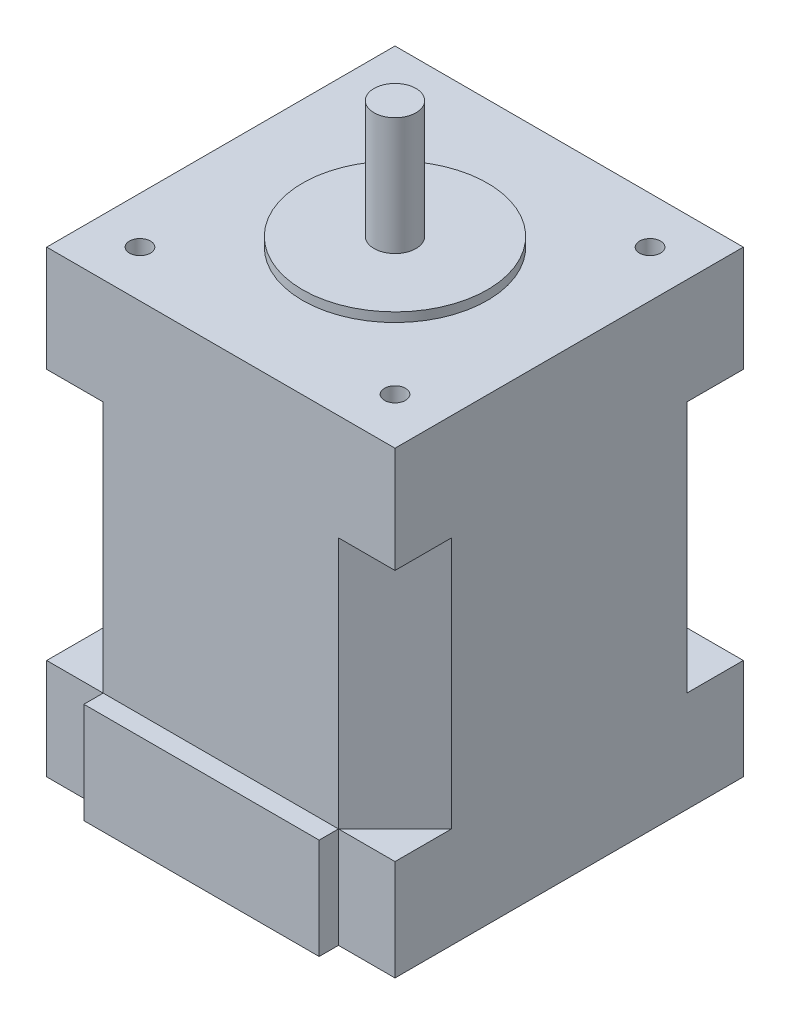
ISO-10303-21;
HEADER;
FILE_DESCRIPTION(('STEP AP214'),'2;1');
FILE_NAME('part.step','',(''),(''),'','','');
FILE_SCHEMA(('AUTOMOTIVE_DESIGN { 1 0 10303 214 1 1 1 1 }'));
ENDSEC;
DATA;
#1=APPLICATION_CONTEXT('core data for automotive mechanical design processes');
#2=APPLICATION_PROTOCOL_DEFINITION('international standard','automotive_design',2000,#1);
#3=PRODUCT_CONTEXT('',#1,'mechanical');
#4=PRODUCT('Part','Part','',(#3));
#5=PRODUCT_RELATED_PRODUCT_CATEGORY('part','',(#4));
#6=PRODUCT_DEFINITION_FORMATION('','',#4);
#7=PRODUCT_DEFINITION_CONTEXT('part definition',#1,'design');
#8=PRODUCT_DEFINITION('design','',#6,#7);
#9=PRODUCT_DEFINITION_SHAPE('','',#8);
#10=(LENGTH_UNIT() NAMED_UNIT(*) SI_UNIT(.MILLI.,.METRE.));
#11=(NAMED_UNIT(*) PLANE_ANGLE_UNIT() SI_UNIT($,.RADIAN.));
#12=(NAMED_UNIT(*) SI_UNIT($,.STERADIAN.) SOLID_ANGLE_UNIT());
#13=UNCERTAINTY_MEASURE_WITH_UNIT(LENGTH_MEASURE(1.E-05),#10,'distance_accuracy_value','');
#14=(GEOMETRIC_REPRESENTATION_CONTEXT(3) GLOBAL_UNCERTAINTY_ASSIGNED_CONTEXT((#13)) GLOBAL_UNIT_ASSIGNED_CONTEXT((#10,
#11,#12)) REPRESENTATION_CONTEXT('',''));
#15=CARTESIAN_POINT('',(0.,0.,0.));
#16=DIRECTION('',(0.,0.,1.));
#17=DIRECTION('',(1.,0.,0.));
#18=AXIS2_PLACEMENT_3D('',#15,#16,#17);
#19=CARTESIAN_POINT('',(-20.725,54.6,20.725));
#20=DIRECTION('',(0.,0.,-1.));
#21=DIRECTION('',(-1.,0.,0.));
#22=AXIS2_PLACEMENT_3D('',#19,#20,#21);
#23=PLANE('',#22);
#24=DIRECTION('',(1.,0.,0.));
#25=VECTOR('',#24,1.);
#26=CARTESIAN_POINT('',(-20.725,42.,20.725));
#27=LINE('',#26,#25);
#28=CARTESIAN_POINT('',(-20.725,42.,20.725));
#29=VERTEX_POINT('',#28);
#30=CARTESIAN_POINT('',(-14.,42.,20.725));
#31=VERTEX_POINT('',#30);
#32=EDGE_CURVE('E189',#29,#31,#27,.T.);
#33=ORIENTED_EDGE('',*,*,#32,.T.);
#34=DIRECTION('',(0.,-1.,0.));
#35=VECTOR('',#34,1.);
#36=CARTESIAN_POINT('',(-14.,42.,20.725));
#37=LINE('',#36,#35);
#38=CARTESIAN_POINT('',(-14.,12.,20.725));
#39=VERTEX_POINT('',#38);
#40=EDGE_CURVE('E174',#31,#39,#37,.T.);
#41=ORIENTED_EDGE('',*,*,#40,.T.);
#42=DIRECTION('',(1.,0.,0.));
#43=VECTOR('',#42,1.);
#44=CARTESIAN_POINT('',(0.,12.,20.725));
#45=LINE('',#44,#43);
#46=CARTESIAN_POINT('',(14.,12.,20.725));
#47=VERTEX_POINT('',#46);
#48=EDGE_CURVE('E335',#39,#47,#45,.T.);
#49=ORIENTED_EDGE('',*,*,#48,.T.);
#50=DIRECTION('',(0.,-1.,0.));
#51=VECTOR('',#50,1.);
#52=CARTESIAN_POINT('',(14.,42.,20.725));
#53=LINE('',#52,#51);
#54=CARTESIAN_POINT('',(14.,42.,20.725));
#55=VERTEX_POINT('',#54);
#56=EDGE_CURVE('E238',#55,#47,#53,.T.);
#57=ORIENTED_EDGE('',*,*,#56,.F.);
#58=DIRECTION('',(-1.,0.,0.));
#59=VECTOR('',#58,1.);
#60=CARTESIAN_POINT('',(20.725,42.,20.725));
#61=LINE('',#60,#59);
#62=CARTESIAN_POINT('',(20.725,42.,20.725));
#63=VERTEX_POINT('',#62);
#64=EDGE_CURVE('E223',#63,#55,#61,.T.);
#65=ORIENTED_EDGE('',*,*,#64,.F.);
#66=DIRECTION('',(0.,-1.,0.));
#67=VECTOR('',#66,1.);
#68=CARTESIAN_POINT('',(20.725,54.6,20.725));
#69=LINE('',#68,#67);
#70=CARTESIAN_POINT('',(20.725,54.6,20.725));
#71=VERTEX_POINT('',#70);
#72=EDGE_CURVE('E416',#71,#63,#69,.T.);
#73=ORIENTED_EDGE('',*,*,#72,.F.);
#74=DIRECTION('',(1.,0.,0.));
#75=VECTOR('',#74,1.);
#76=CARTESIAN_POINT('',(-20.725,54.6,20.725));
#77=LINE('',#76,#75);
#78=CARTESIAN_POINT('',(-20.725,54.6,20.725));
#79=VERTEX_POINT('',#78);
#80=EDGE_CURVE('E397',#79,#71,#77,.T.);
#81=ORIENTED_EDGE('',*,*,#80,.F.);
#82=DIRECTION('',(0.,-1.,0.));
#83=VECTOR('',#82,1.);
#84=CARTESIAN_POINT('',(-20.725,54.6,20.725));
#85=LINE('',#84,#83);
#86=EDGE_CURVE('E197',#79,#29,#85,.T.);
#87=ORIENTED_EDGE('',*,*,#86,.T.);
#88=EDGE_LOOP('',(#33,#41,#49,#57,#65,#73,#81,#87));
#89=FACE_BOUND('',#88,.T.);
#90=ADVANCED_FACE('F40',(#89),#23,.F.);
#91=CARTESIAN_POINT('',(-20.725,54.6,-20.725));
#92=DIRECTION('',(1.,0.,0.));
#93=DIRECTION('',(0.,0.,-1.));
#94=AXIS2_PLACEMENT_3D('',#91,#92,#93);
#95=PLANE('',#94);
#96=DIRECTION('',(0.,0.,1.));
#97=VECTOR('',#96,1.);
#98=CARTESIAN_POINT('',(-20.725,42.,14.));
#99=LINE('',#98,#97);
#100=CARTESIAN_POINT('',(-20.725,42.,14.));
#101=VERTEX_POINT('',#100);
#102=EDGE_CURVE('E185',#101,#29,#99,.T.);
#103=ORIENTED_EDGE('',*,*,#102,.T.);
#104=ORIENTED_EDGE('',*,*,#86,.F.);
#105=DIRECTION('',(0.,0.,1.));
#106=VECTOR('',#105,1.);
#107=CARTESIAN_POINT('',(-20.725,54.6,-20.725));
#108=LINE('',#107,#106);
#109=CARTESIAN_POINT('',(-20.725,54.6,-20.725));
#110=VERTEX_POINT('',#109);
#111=EDGE_CURVE('E394',#110,#79,#108,.T.);
#112=ORIENTED_EDGE('',*,*,#111,.F.);
#113=DIRECTION('',(0.,-1.,0.));
#114=VECTOR('',#113,1.);
#115=CARTESIAN_POINT('',(-20.725,54.6,-20.725));
#116=LINE('',#115,#114);
#117=CARTESIAN_POINT('',(-20.725,42.,-20.725));
#118=VERTEX_POINT('',#117);
#119=EDGE_CURVE('E423',#110,#118,#116,.T.);
#120=ORIENTED_EDGE('',*,*,#119,.T.);
#121=DIRECTION('',(0.,0.,-1.));
#122=VECTOR('',#121,1.);
#123=CARTESIAN_POINT('',(-20.725,42.,-14.));
#124=LINE('',#123,#122);
#125=CARTESIAN_POINT('',(-20.725,42.,-14.));
#126=VERTEX_POINT('',#125);
#127=EDGE_CURVE('E277',#126,#118,#124,.T.);
#128=ORIENTED_EDGE('',*,*,#127,.F.);
#129=DIRECTION('',(0.,-1.,0.));
#130=VECTOR('',#129,1.);
#131=CARTESIAN_POINT('',(-20.725,42.,-14.));
#132=LINE('',#131,#130);
#133=CARTESIAN_POINT('',(-20.725,12.,-14.));
#134=VERTEX_POINT('',#133);
#135=EDGE_CURVE('E285',#126,#134,#132,.T.);
#136=ORIENTED_EDGE('',*,*,#135,.T.);
#137=DIRECTION('',(0.,0.,-1.));
#138=VECTOR('',#137,1.);
#139=CARTESIAN_POINT('',(-20.725,12.,-14.));
#140=LINE('',#139,#138);
#141=CARTESIAN_POINT('',(-20.725,12.,-20.725));
#142=VERTEX_POINT('',#141);
#143=EDGE_CURVE('E289',#134,#142,#140,.T.);
#144=ORIENTED_EDGE('',*,*,#143,.T.);
#145=CARTESIAN_POINT('',(-20.725,0.,-20.725));
#146=VERTEX_POINT('',#145);
#147=EDGE_CURVE('E422',#142,#146,#116,.T.);
#148=ORIENTED_EDGE('',*,*,#147,.T.);
#149=DIRECTION('',(0.,0.,1.));
#150=VECTOR('',#149,1.);
#151=CARTESIAN_POINT('',(-20.725,0.,-20.725));
#152=LINE('',#151,#150);
#153=CARTESIAN_POINT('',(-20.725,0.,20.725));
#154=VERTEX_POINT('',#153);
#155=EDGE_CURVE('E408',#146,#154,#152,.T.);
#156=ORIENTED_EDGE('',*,*,#155,.T.);
#157=CARTESIAN_POINT('',(-20.725,12.,20.725));
#158=VERTEX_POINT('',#157);
#159=EDGE_CURVE('E420',#158,#154,#85,.T.);
#160=ORIENTED_EDGE('',*,*,#159,.F.);
#161=DIRECTION('',(0.,0.,1.));
#162=VECTOR('',#161,1.);
#163=CARTESIAN_POINT('',(-20.725,12.,14.));
#164=LINE('',#163,#162);
#165=CARTESIAN_POINT('',(-20.725,12.,14.));
#166=VERTEX_POINT('',#165);
#167=EDGE_CURVE('E192',#166,#158,#164,.T.);
#168=ORIENTED_EDGE('',*,*,#167,.F.);
#169=DIRECTION('',(0.,-1.,0.));
#170=VECTOR('',#169,1.);
#171=CARTESIAN_POINT('',(-20.725,42.,14.));
#172=LINE('',#171,#170);
#173=EDGE_CURVE('E184',#101,#166,#172,.T.);
#174=ORIENTED_EDGE('',*,*,#173,.F.);
#175=EDGE_LOOP('',(#103,#104,#112,#120,#128,#136,#144,#148,#156,#160,#168,#174));
#176=FACE_BOUND('',#175,.T.);
#177=ADVANCED_FACE('F434',(#176),#95,.F.);
#178=CARTESIAN_POINT('',(20.725,54.6,-20.725));
#179=DIRECTION('',(-1.,0.,0.));
#180=DIRECTION('',(0.,0.,1.));
#181=AXIS2_PLACEMENT_3D('',#178,#179,#180);
#182=PLANE('',#181);
#183=DIRECTION('',(0.,0.,1.));
#184=VECTOR('',#183,1.);
#185=CARTESIAN_POINT('',(20.725,42.,14.));
#186=LINE('',#185,#184);
#187=CARTESIAN_POINT('',(20.725,42.,14.));
#188=VERTEX_POINT('',#187);
#189=EDGE_CURVE('E219',#188,#63,#186,.T.);
#190=ORIENTED_EDGE('',*,*,#189,.F.);
#191=DIRECTION('',(0.,-1.,0.));
#192=VECTOR('',#191,1.);
#193=CARTESIAN_POINT('',(20.725,42.,14.));
#194=LINE('',#193,#192);
#195=CARTESIAN_POINT('',(20.725,12.,14.));
#196=VERTEX_POINT('',#195);
#197=EDGE_CURVE('E227',#188,#196,#194,.T.);
#198=ORIENTED_EDGE('',*,*,#197,.T.);
#199=DIRECTION('',(0.,0.,1.));
#200=VECTOR('',#199,1.);
#201=CARTESIAN_POINT('',(20.725,12.,14.));
#202=LINE('',#201,#200);
#203=CARTESIAN_POINT('',(20.725,12.,20.725));
#204=VERTEX_POINT('',#203);
#205=EDGE_CURVE('E231',#196,#204,#202,.T.);
#206=ORIENTED_EDGE('',*,*,#205,.T.);
#207=CARTESIAN_POINT('',(20.725,0.,20.725));
#208=VERTEX_POINT('',#207);
#209=EDGE_CURVE('E400',#204,#208,#69,.T.);
#210=ORIENTED_EDGE('',*,*,#209,.T.);
#211=DIRECTION('',(0.,0.,-1.));
#212=VECTOR('',#211,1.);
#213=CARTESIAN_POINT('',(20.725,0.,-20.725));
#214=LINE('',#213,#212);
#215=CARTESIAN_POINT('',(20.725,0.,-20.725));
#216=VERTEX_POINT('',#215);
#217=EDGE_CURVE('E382',#208,#216,#214,.T.);
#218=ORIENTED_EDGE('',*,*,#217,.T.);
#219=DIRECTION('',(0.,-1.,0.));
#220=VECTOR('',#219,1.);
#221=CARTESIAN_POINT('',(20.725,54.6,-20.725));
#222=LINE('',#221,#220);
#223=CARTESIAN_POINT('',(20.725,12.,-20.725));
#224=VERTEX_POINT('',#223);
#225=EDGE_CURVE('E426',#224,#216,#222,.T.);
#226=ORIENTED_EDGE('',*,*,#225,.F.);
#227=DIRECTION('',(0.,0.,-1.));
#228=VECTOR('',#227,1.);
#229=CARTESIAN_POINT('',(20.725,12.,-14.));
#230=LINE('',#229,#228);
#231=CARTESIAN_POINT('',(20.725,12.,-14.));
#232=VERTEX_POINT('',#231);
#233=EDGE_CURVE('E250',#232,#224,#230,.T.);
#234=ORIENTED_EDGE('',*,*,#233,.F.);
#235=DIRECTION('',(0.,-1.,0.));
#236=VECTOR('',#235,1.);
#237=CARTESIAN_POINT('',(20.725,42.,-14.));
#238=LINE('',#237,#236);
#239=CARTESIAN_POINT('',(20.725,42.,-14.));
#240=VERTEX_POINT('',#239);
#241=EDGE_CURVE('E266',#240,#232,#238,.T.);
#242=ORIENTED_EDGE('',*,*,#241,.F.);
#243=DIRECTION('',(0.,0.,-1.));
#244=VECTOR('',#243,1.);
#245=CARTESIAN_POINT('',(20.725,42.,-14.));
#246=LINE('',#245,#244);
#247=CARTESIAN_POINT('',(20.725,42.,-20.725));
#248=VERTEX_POINT('',#247);
#249=EDGE_CURVE('E254',#240,#248,#246,.T.);
#250=ORIENTED_EDGE('',*,*,#249,.T.);
#251=CARTESIAN_POINT('',(20.725,54.6,-20.725));
#252=VERTEX_POINT('',#251);
#253=EDGE_CURVE('E44',#252,#248,#222,.T.);
#254=ORIENTED_EDGE('',*,*,#253,.F.);
#255=DIRECTION('',(0.,0.,-1.));
#256=VECTOR('',#255,1.);
#257=CARTESIAN_POINT('',(20.725,54.6,-20.725));
#258=LINE('',#257,#256);
#259=EDGE_CURVE('E386',#71,#252,#258,.T.);
#260=ORIENTED_EDGE('',*,*,#259,.F.);
#261=ORIENTED_EDGE('',*,*,#72,.T.);
#262=EDGE_LOOP('',(#190,#198,#206,#210,#218,#226,#234,#242,#250,#254,#260,#261));
#263=FACE_BOUND('',#262,.T.);
#264=ADVANCED_FACE('F42',(#263),#182,.F.);
#265=DIRECTION('',(0.,-1.,0.));
#266=VECTOR('',#265,1.);
#267=CARTESIAN_POINT('',(-14.,12.,20.725));
#268=LINE('',#267,#266);
#269=CARTESIAN_POINT('',(-14.,0.,20.725));
#270=VERTEX_POINT('',#269);
#271=EDGE_CURVE('E362',#39,#270,#268,.T.);
#272=ORIENTED_EDGE('',*,*,#271,.F.);
#273=DIRECTION('',(1.,0.,0.));
#274=VECTOR('',#273,1.);
#275=CARTESIAN_POINT('',(-20.725,12.,20.725));
#276=LINE('',#275,#274);
#277=EDGE_CURVE('E206',#158,#39,#276,.T.);
#278=ORIENTED_EDGE('',*,*,#277,.F.);
#279=ORIENTED_EDGE('',*,*,#159,.T.);
#280=DIRECTION('',(1.,0.,0.));
#281=VECTOR('',#280,1.);
#282=CARTESIAN_POINT('',(-20.725,0.,20.725));
#283=LINE('',#282,#281);
#284=EDGE_CURVE('E391',#154,#270,#283,.T.);
#285=ORIENTED_EDGE('',*,*,#284,.T.);
#286=EDGE_LOOP('',(#272,#278,#279,#285));
#287=FACE_BOUND('',#286,.T.);
#288=ADVANCED_FACE('F449',(#287),#23,.F.);
#289=CARTESIAN_POINT('',(-20.725,54.6,-20.725));
#290=DIRECTION('',(0.,0.,1.));
#291=DIRECTION('',(1.,0.,0.));
#292=AXIS2_PLACEMENT_3D('',#289,#290,#291);
#293=PLANE('',#292);
#294=DIRECTION('',(-1.,0.,0.));
#295=VECTOR('',#294,1.);
#296=CARTESIAN_POINT('',(20.725,42.,-20.725));
#297=LINE('',#296,#295);
#298=CARTESIAN_POINT('',(14.,42.,-20.725));
#299=VERTEX_POINT('',#298);
#300=EDGE_CURVE('E249',#248,#299,#297,.T.);
#301=ORIENTED_EDGE('',*,*,#300,.T.);
#302=DIRECTION('',(0.,-1.,0.));
#303=VECTOR('',#302,1.);
#304=CARTESIAN_POINT('',(14.,42.,-20.725));
#305=LINE('',#304,#303);
#306=CARTESIAN_POINT('',(14.,12.,-20.725));
#307=VERTEX_POINT('',#306);
#308=EDGE_CURVE('E258',#299,#307,#305,.T.);
#309=ORIENTED_EDGE('',*,*,#308,.T.);
#310=DIRECTION('',(-1.,0.,0.));
#311=VECTOR('',#310,1.);
#312=CARTESIAN_POINT('',(20.725,12.,-20.725));
#313=LINE('',#312,#311);
#314=EDGE_CURVE('E261',#224,#307,#313,.T.);
#315=ORIENTED_EDGE('',*,*,#314,.F.);
#316=ORIENTED_EDGE('',*,*,#225,.T.);
#317=DIRECTION('',(-1.,0.,0.));
#318=VECTOR('',#317,1.);
#319=CARTESIAN_POINT('',(-20.725,0.,-20.725));
#320=LINE('',#319,#318);
#321=EDGE_CURVE('E404',#216,#146,#320,.T.);
#322=ORIENTED_EDGE('',*,*,#321,.T.);
#323=ORIENTED_EDGE('',*,*,#147,.F.);
#324=DIRECTION('',(1.,0.,0.));
#325=VECTOR('',#324,1.);
#326=CARTESIAN_POINT('',(-20.725,12.,-20.725));
#327=LINE('',#326,#325);
#328=CARTESIAN_POINT('',(-14.,12.,-20.725));
#329=VERTEX_POINT('',#328);
#330=EDGE_CURVE('E278',#142,#329,#327,.T.);
#331=ORIENTED_EDGE('',*,*,#330,.T.);
#332=DIRECTION('',(0.,-1.,0.));
#333=VECTOR('',#332,1.);
#334=CARTESIAN_POINT('',(-14.,42.,-20.725));
#335=LINE('',#334,#333);
#336=CARTESIAN_POINT('',(-14.,42.,-20.725));
#337=VERTEX_POINT('',#336);
#338=EDGE_CURVE('E296',#337,#329,#335,.T.);
#339=ORIENTED_EDGE('',*,*,#338,.F.);
#340=DIRECTION('',(1.,0.,0.));
#341=VECTOR('',#340,1.);
#342=CARTESIAN_POINT('',(-20.725,42.,-20.725));
#343=LINE('',#342,#341);
#344=EDGE_CURVE('E281',#118,#337,#343,.T.);
#345=ORIENTED_EDGE('',*,*,#344,.F.);
#346=ORIENTED_EDGE('',*,*,#119,.F.);
#347=DIRECTION('',(-1.,0.,0.));
#348=VECTOR('',#347,1.);
#349=CARTESIAN_POINT('',(-20.725,54.6,-20.725));
#350=LINE('',#349,#348);
#351=EDGE_CURVE('E390',#252,#110,#350,.T.);
#352=ORIENTED_EDGE('',*,*,#351,.F.);
#353=ORIENTED_EDGE('',*,*,#253,.T.);
#354=EDGE_LOOP('',(#301,#309,#315,#316,#322,#323,#331,#339,#345,#346,#352,#353));
#355=FACE_BOUND('',#354,.T.);
#356=ADVANCED_FACE('F440',(#355),#293,.F.);
#357=ORIENTED_EDGE('',*,*,#209,.F.);
#358=DIRECTION('',(-1.,0.,0.));
#359=VECTOR('',#358,1.);
#360=CARTESIAN_POINT('',(20.725,12.,20.725));
#361=LINE('',#360,#359);
#362=EDGE_CURVE('E220',#204,#47,#361,.T.);
#363=ORIENTED_EDGE('',*,*,#362,.T.);
#364=DIRECTION('',(0.,-1.,0.));
#365=VECTOR('',#364,1.);
#366=CARTESIAN_POINT('',(14.,12.,20.725));
#367=LINE('',#366,#365);
#368=CARTESIAN_POINT('',(14.,0.,20.725));
#369=VERTEX_POINT('',#368);
#370=EDGE_CURVE('E351',#47,#369,#367,.T.);
#371=ORIENTED_EDGE('',*,*,#370,.T.);
#372=EDGE_CURVE('E412',#369,#208,#283,.T.);
#373=ORIENTED_EDGE('',*,*,#372,.T.);
#374=EDGE_LOOP('',(#357,#363,#371,#373));
#375=FACE_BOUND('',#374,.T.);
#376=ADVANCED_FACE('F459',(#375),#23,.F.);
#377=CARTESIAN_POINT('',(0.,54.6,0.));
#378=DIRECTION('',(0.,1.,0.));
#379=DIRECTION('',(0.,0.,1.));
#380=AXIS2_PLACEMENT_3D('',#377,#378,#379);
#381=PLANE('',#380);
#382=CARTESIAN_POINT('',(-15.175,54.6,-15.175));
#383=DIRECTION('',(0.,-1.,0.));
#384=DIRECTION('',(0.,0.,1.));
#385=AXIS2_PLACEMENT_3D('',#382,#383,#384);
#386=CIRCLE('',#385,1.25);
#387=CARTESIAN_POINT('',(-15.175,54.6,-13.925));
#388=VERTEX_POINT('',#387);
#389=EDGE_CURVE('E299',#388,#388,#386,.T.);
#390=ORIENTED_EDGE('',*,*,#389,.T.);
#391=EDGE_LOOP('',(#390));
#392=FACE_BOUND('',#391,.T.);
#393=CARTESIAN_POINT('',(-15.175,54.6,15.175));
#394=DIRECTION('',(0.,1.,0.));
#395=DIRECTION('',(0.,0.,-1.));
#396=AXIS2_PLACEMENT_3D('',#393,#394,#395);
#397=CIRCLE('',#396,1.25);
#398=CARTESIAN_POINT('',(-15.175,54.6,13.925));
#399=VERTEX_POINT('',#398);
#400=EDGE_CURVE('E307',#399,#399,#397,.T.);
#401=ORIENTED_EDGE('',*,*,#400,.F.);
#402=EDGE_LOOP('',(#401));
#403=FACE_BOUND('',#402,.T.);
#404=CARTESIAN_POINT('',(15.175,54.6,15.175));
#405=DIRECTION('',(0.,-1.,0.));
#406=DIRECTION('',(0.,0.,-1.));
#407=AXIS2_PLACEMENT_3D('',#404,#405,#406);
#408=CIRCLE('',#407,1.25);
#409=CARTESIAN_POINT('',(15.175,54.6,13.925));
#410=VERTEX_POINT('',#409);
#411=EDGE_CURVE('E315',#410,#410,#408,.T.);
#412=ORIENTED_EDGE('',*,*,#411,.T.);
#413=EDGE_LOOP('',(#412));
#414=FACE_BOUND('',#413,.T.);
#415=CARTESIAN_POINT('',(15.175,54.6,-15.175));
#416=DIRECTION('',(0.,1.,0.));
#417=DIRECTION('',(0.,0.,1.));
#418=AXIS2_PLACEMENT_3D('',#415,#416,#417);
#419=CIRCLE('',#418,1.25);
#420=CARTESIAN_POINT('',(15.175,54.6,-13.925));
#421=VERTEX_POINT('',#420);
#422=EDGE_CURVE('E323',#421,#421,#419,.T.);
#423=ORIENTED_EDGE('',*,*,#422,.F.);
#424=EDGE_LOOP('',(#423));
#425=FACE_BOUND('',#424,.T.);
#426=CARTESIAN_POINT('',(0.,54.6,0.));
#427=DIRECTION('',(0.,1.,0.));
#428=DIRECTION('',(0.,0.,1.));
#429=AXIS2_PLACEMENT_3D('',#426,#427,#428);
#430=CIRCLE('',#429,11.);
#431=CARTESIAN_POINT('',(0.,54.6,11.));
#432=VERTEX_POINT('',#431);
#433=EDGE_CURVE('E50',#432,#432,#430,.T.);
#434=ORIENTED_EDGE('',*,*,#433,.F.);
#435=EDGE_LOOP('',(#434));
#436=FACE_BOUND('',#435,.T.);
#437=ORIENTED_EDGE('',*,*,#259,.T.);
#438=ORIENTED_EDGE('',*,*,#351,.T.);
#439=ORIENTED_EDGE('',*,*,#111,.T.);
#440=ORIENTED_EDGE('',*,*,#80,.T.);
#441=EDGE_LOOP('',(#437,#438,#439,#440));
#442=FACE_BOUND('',#441,.T.);
#443=ADVANCED_FACE('F503',(#392,#403,#414,#425,#436,#442),#381,.T.);
#444=CARTESIAN_POINT('',(0.,0.,0.));
#445=DIRECTION('',(0.,1.,0.));
#446=DIRECTION('',(0.,0.,1.));
#447=AXIS2_PLACEMENT_3D('',#444,#445,#446);
#448=PLANE('',#447);
#449=CARTESIAN_POINT('',(0.,0.,0.));
#450=DIRECTION('',(0.,-1.,0.));
#451=DIRECTION('',(0.,0.,-1.));
#452=AXIS2_PLACEMENT_3D('',#449,#450,#451);
#453=CIRCLE('',#452,4.45);
#454=CARTESIAN_POINT('',(0.,0.,-4.45));
#455=VERTEX_POINT('',#454);
#456=EDGE_CURVE('E738',#455,#455,#453,.T.);
#457=ORIENTED_EDGE('',*,*,#456,.F.);
#458=EDGE_LOOP('',(#457));
#459=FACE_BOUND('',#458,.T.);
#460=ORIENTED_EDGE('',*,*,#217,.F.);
#461=ORIENTED_EDGE('',*,*,#372,.F.);
#462=DIRECTION('',(0.,0.,1.));
#463=VECTOR('',#462,1.);
#464=CARTESIAN_POINT('',(14.,0.,23.025));
#465=LINE('',#464,#463);
#466=CARTESIAN_POINT('',(14.,0.,23.025));
#467=VERTEX_POINT('',#466);
#468=EDGE_CURVE('E331',#369,#467,#465,.T.);
#469=ORIENTED_EDGE('',*,*,#468,.T.);
#470=DIRECTION('',(-1.,0.,0.));
#471=VECTOR('',#470,1.);
#472=CARTESIAN_POINT('',(-14.,0.,23.025));
#473=LINE('',#472,#471);
#474=CARTESIAN_POINT('',(-14.,0.,23.025));
#475=VERTEX_POINT('',#474);
#476=EDGE_CURVE('E355',#467,#475,#473,.T.);
#477=ORIENTED_EDGE('',*,*,#476,.T.);
#478=DIRECTION('',(0.,0.,-1.));
#479=VECTOR('',#478,1.);
#480=CARTESIAN_POINT('',(-14.,0.,20.725));
#481=LINE('',#480,#479);
#482=EDGE_CURVE('E339',#475,#270,#481,.T.);
#483=ORIENTED_EDGE('',*,*,#482,.T.);
#484=ORIENTED_EDGE('',*,*,#284,.F.);
#485=ORIENTED_EDGE('',*,*,#155,.F.);
#486=ORIENTED_EDGE('',*,*,#321,.F.);
#487=EDGE_LOOP('',(#460,#461,#469,#477,#483,#484,#485,#486));
#488=FACE_BOUND('',#487,.T.);
#489=ADVANCED_FACE('F445',(#459,#488),#448,.F.);
#490=CARTESIAN_POINT('',(0.,55.7,0.));
#491=DIRECTION('',(0.,-1.,0.));
#492=DIRECTION('',(0.,0.,-1.));
#493=AXIS2_PLACEMENT_3D('',#490,#491,#492);
#494=CYLINDRICAL_SURFACE('',#493,11.);
#495=CARTESIAN_POINT('',(0.,55.7,0.));
#496=DIRECTION('',(0.,1.,0.));
#497=DIRECTION('',(0.,0.,1.));
#498=AXIS2_PLACEMENT_3D('',#495,#496,#497);
#499=CIRCLE('',#498,11.);
#500=CARTESIAN_POINT('',(0.,55.7,11.));
#501=VERTEX_POINT('',#500);
#502=EDGE_CURVE('E377',#501,#501,#499,.T.);
#503=ORIENTED_EDGE('',*,*,#502,.F.);
#504=EDGE_LOOP('',(#503));
#505=FACE_BOUND('',#504,.T.);
#506=ORIENTED_EDGE('',*,*,#433,.T.);
#507=EDGE_LOOP('',(#506));
#508=FACE_BOUND('',#507,.T.);
#509=ADVANCED_FACE('F729',(#505,#508),#494,.T.);
#510=CARTESIAN_POINT('',(0.,55.7,0.));
#511=DIRECTION('',(0.,1.,0.));
#512=DIRECTION('',(0.,0.,1.));
#513=AXIS2_PLACEMENT_3D('',#510,#511,#512);
#514=PLANE('',#513);
#515=CARTESIAN_POINT('',(0.,55.7,0.));
#516=DIRECTION('',(0.,1.,0.));
#517=DIRECTION('',(0.,0.,1.));
#518=AXIS2_PLACEMENT_3D('',#515,#516,#517);
#519=CIRCLE('',#518,2.5);
#520=CARTESIAN_POINT('',(0.,55.7,2.5));
#521=VERTEX_POINT('',#520);
#522=EDGE_CURVE('E11',#521,#521,#519,.T.);
#523=ORIENTED_EDGE('',*,*,#522,.F.);
#524=EDGE_LOOP('',(#523));
#525=FACE_BOUND('',#524,.T.);
#526=ORIENTED_EDGE('',*,*,#502,.T.);
#527=EDGE_LOOP('',(#526));
#528=FACE_BOUND('',#527,.T.);
#529=ADVANCED_FACE('F725',(#525,#528),#514,.T.);
#530=CARTESIAN_POINT('',(0.,69.7,0.));
#531=DIRECTION('',(0.,-1.,0.));
#532=DIRECTION('',(0.,0.,-1.));
#533=AXIS2_PLACEMENT_3D('',#530,#531,#532);
#534=CYLINDRICAL_SURFACE('',#533,2.5);
#535=CARTESIAN_POINT('',(0.,69.7,0.));
#536=DIRECTION('',(0.,1.,0.));
#537=DIRECTION('',(0.,0.,1.));
#538=AXIS2_PLACEMENT_3D('',#535,#536,#537);
#539=CIRCLE('',#538,2.5);
#540=CARTESIAN_POINT('',(0.,69.7,2.5));
#541=VERTEX_POINT('',#540);
#542=EDGE_CURVE('E365',#541,#541,#539,.T.);
#543=ORIENTED_EDGE('',*,*,#542,.F.);
#544=EDGE_LOOP('',(#543));
#545=FACE_BOUND('',#544,.T.);
#546=ORIENTED_EDGE('',*,*,#522,.T.);
#547=EDGE_LOOP('',(#546));
#548=FACE_BOUND('',#547,.T.);
#549=ADVANCED_FACE('F490',(#545,#548),#534,.T.);
#550=CARTESIAN_POINT('',(0.,69.7,0.));
#551=DIRECTION('',(0.,1.,0.));
#552=DIRECTION('',(0.,0.,1.));
#553=AXIS2_PLACEMENT_3D('',#550,#551,#552);
#554=PLANE('',#553);
#555=ORIENTED_EDGE('',*,*,#542,.T.);
#556=EDGE_LOOP('',(#555));
#557=FACE_BOUND('',#556,.T.);
#558=ADVANCED_FACE('F483',(#557),#554,.T.);
#559=CARTESIAN_POINT('',(-14.,12.,20.725));
#560=DIRECTION('',(-1.,0.,0.));
#561=DIRECTION('',(0.,0.,1.));
#562=AXIS2_PLACEMENT_3D('',#559,#560,#561);
#563=PLANE('',#562);
#564=ORIENTED_EDGE('',*,*,#482,.F.);
#565=DIRECTION('',(0.,-1.,0.));
#566=VECTOR('',#565,1.);
#567=CARTESIAN_POINT('',(-14.,12.,23.025));
#568=LINE('',#567,#566);
#569=CARTESIAN_POINT('',(-14.,12.,23.025));
#570=VERTEX_POINT('',#569);
#571=EDGE_CURVE('E366',#570,#475,#568,.T.);
#572=ORIENTED_EDGE('',*,*,#571,.F.);
#573=DIRECTION('',(0.,0.,-1.));
#574=VECTOR('',#573,1.);
#575=CARTESIAN_POINT('',(-14.,12.,20.725));
#576=LINE('',#575,#574);
#577=EDGE_CURVE('E347',#570,#39,#576,.T.);
#578=ORIENTED_EDGE('',*,*,#577,.T.);
#579=ORIENTED_EDGE('',*,*,#271,.T.);
#580=EDGE_LOOP('',(#564,#572,#578,#579));
#581=FACE_BOUND('',#580,.T.);
#582=ADVANCED_FACE('F481',(#581),#563,.T.);
#583=CARTESIAN_POINT('',(-14.,12.,23.025));
#584=DIRECTION('',(0.,0.,1.));
#585=DIRECTION('',(1.,0.,0.));
#586=AXIS2_PLACEMENT_3D('',#583,#584,#585);
#587=PLANE('',#586);
#588=ORIENTED_EDGE('',*,*,#476,.F.);
#589=DIRECTION('',(0.,-1.,0.));
#590=VECTOR('',#589,1.);
#591=CARTESIAN_POINT('',(14.,12.,23.025));
#592=LINE('',#591,#590);
#593=CARTESIAN_POINT('',(14.,12.,23.025));
#594=VERTEX_POINT('',#593);
#595=EDGE_CURVE('E369',#594,#467,#592,.T.);
#596=ORIENTED_EDGE('',*,*,#595,.F.);
#597=DIRECTION('',(-1.,0.,0.));
#598=VECTOR('',#597,1.);
#599=CARTESIAN_POINT('',(-14.,12.,23.025));
#600=LINE('',#599,#598);
#601=EDGE_CURVE('E343',#594,#570,#600,.T.);
#602=ORIENTED_EDGE('',*,*,#601,.T.);
#603=ORIENTED_EDGE('',*,*,#571,.T.);
#604=EDGE_LOOP('',(#588,#596,#602,#603));
#605=FACE_BOUND('',#604,.T.);
#606=ADVANCED_FACE('F479',(#605),#587,.T.);
#607=CARTESIAN_POINT('',(14.,12.,23.025));
#608=DIRECTION('',(1.,0.,0.));
#609=DIRECTION('',(0.,0.,-1.));
#610=AXIS2_PLACEMENT_3D('',#607,#608,#609);
#611=PLANE('',#610);
#612=ORIENTED_EDGE('',*,*,#468,.F.);
#613=ORIENTED_EDGE('',*,*,#370,.F.);
#614=DIRECTION('',(0.,0.,1.));
#615=VECTOR('',#614,1.);
#616=CARTESIAN_POINT('',(14.,12.,23.025));
#617=LINE('',#616,#615);
#618=EDGE_CURVE('E338',#47,#594,#617,.T.);
#619=ORIENTED_EDGE('',*,*,#618,.T.);
#620=ORIENTED_EDGE('',*,*,#595,.T.);
#621=EDGE_LOOP('',(#612,#613,#619,#620));
#622=FACE_BOUND('',#621,.T.);
#623=ADVANCED_FACE('F472',(#622),#611,.T.);
#624=CARTESIAN_POINT('',(0.,12.,0.));
#625=DIRECTION('',(0.,1.,0.));
#626=DIRECTION('',(0.,0.,1.));
#627=AXIS2_PLACEMENT_3D('',#624,#625,#626);
#628=PLANE('',#627);
#629=ORIENTED_EDGE('',*,*,#48,.F.);
#630=ORIENTED_EDGE('',*,*,#577,.F.);
#631=ORIENTED_EDGE('',*,*,#601,.F.);
#632=ORIENTED_EDGE('',*,*,#618,.F.);
#633=EDGE_LOOP('',(#629,#630,#631,#632));
#634=FACE_BOUND('',#633,.T.);
#635=ADVANCED_FACE('F475',(#634),#628,.T.);
#636=CARTESIAN_POINT('',(15.175,42.6,-15.175));
#637=DIRECTION('',(0.,1.,0.));
#638=DIRECTION('',(0.,0.,1.));
#639=AXIS2_PLACEMENT_3D('',#636,#637,#638);
#640=CYLINDRICAL_SURFACE('',#639,1.25);
#641=CARTESIAN_POINT('',(15.175,42.6,-15.175));
#642=DIRECTION('',(0.,1.,0.));
#643=DIRECTION('',(0.,0.,1.));
#644=AXIS2_PLACEMENT_3D('',#641,#642,#643);
#645=CIRCLE('',#644,1.25);
#646=CARTESIAN_POINT('',(15.175,42.6,-13.925));
#647=VERTEX_POINT('',#646);
#648=EDGE_CURVE('E327',#647,#647,#645,.T.);
#649=ORIENTED_EDGE('',*,*,#648,.F.);
#650=EDGE_LOOP('',(#649));
#651=FACE_BOUND('',#650,.T.);
#652=ORIENTED_EDGE('',*,*,#422,.T.);
#653=EDGE_LOOP('',(#652));
#654=FACE_BOUND('',#653,.T.);
#655=ADVANCED_FACE('F712',(#651,#654),#640,.F.);
#656=CARTESIAN_POINT('',(15.175,42.6,-15.175));
#657=DIRECTION('',(0.,1.,0.));
#658=DIRECTION('',(0.,0.,1.));
#659=AXIS2_PLACEMENT_3D('',#656,#657,#658);
#660=PLANE('',#659);
#661=ORIENTED_EDGE('',*,*,#648,.T.);
#662=EDGE_LOOP('',(#661));
#663=FACE_BOUND('',#662,.T.);
#664=ADVANCED_FACE('F609',(#663),#660,.T.);
#665=CARTESIAN_POINT('',(15.175,42.6,15.175));
#666=DIRECTION('',(0.,1.,0.));
#667=DIRECTION('',(0.,0.,1.));
#668=AXIS2_PLACEMENT_3D('',#665,#666,#667);
#669=CYLINDRICAL_SURFACE('',#668,1.25);
#670=CARTESIAN_POINT('',(15.175,42.6,15.175));
#671=DIRECTION('',(0.,-1.,0.));
#672=DIRECTION('',(0.,0.,-1.));
#673=AXIS2_PLACEMENT_3D('',#670,#671,#672);
#674=CIRCLE('',#673,1.25);
#675=CARTESIAN_POINT('',(15.175,42.6,13.925));
#676=VERTEX_POINT('',#675);
#677=EDGE_CURVE('E319',#676,#676,#674,.T.);
#678=ORIENTED_EDGE('',*,*,#677,.T.);
#679=EDGE_LOOP('',(#678));
#680=FACE_BOUND('',#679,.T.);
#681=ORIENTED_EDGE('',*,*,#411,.F.);
#682=EDGE_LOOP('',(#681));
#683=FACE_BOUND('',#682,.T.);
#684=ADVANCED_FACE('F603',(#680,#683),#669,.F.);
#685=CARTESIAN_POINT('',(15.175,42.6,15.175));
#686=DIRECTION('',(0.,1.,0.));
#687=DIRECTION('',(0.,0.,-1.));
#688=AXIS2_PLACEMENT_3D('',#685,#686,#687);
#689=PLANE('',#688);
#690=ORIENTED_EDGE('',*,*,#677,.F.);
#691=EDGE_LOOP('',(#690));
#692=FACE_BOUND('',#691,.T.);
#693=ADVANCED_FACE('F608',(#692),#689,.T.);
#694=CARTESIAN_POINT('',(-15.175,42.6,15.175));
#695=DIRECTION('',(0.,1.,0.));
#696=DIRECTION('',(0.,0.,1.));
#697=AXIS2_PLACEMENT_3D('',#694,#695,#696);
#698=CYLINDRICAL_SURFACE('',#697,1.25);
#699=CARTESIAN_POINT('',(-15.175,42.6,15.175));
#700=DIRECTION('',(0.,1.,0.));
#701=DIRECTION('',(0.,0.,-1.));
#702=AXIS2_PLACEMENT_3D('',#699,#700,#701);
#703=CIRCLE('',#702,1.25);
#704=CARTESIAN_POINT('',(-15.175,42.6,13.925));
#705=VERTEX_POINT('',#704);
#706=EDGE_CURVE('E311',#705,#705,#703,.T.);
#707=ORIENTED_EDGE('',*,*,#706,.F.);
#708=EDGE_LOOP('',(#707));
#709=FACE_BOUND('',#708,.T.);
#710=ORIENTED_EDGE('',*,*,#400,.T.);
#711=EDGE_LOOP('',(#710));
#712=FACE_BOUND('',#711,.T.);
#713=ADVANCED_FACE('F635',(#709,#712),#698,.F.);
#714=CARTESIAN_POINT('',(-15.175,42.6,15.175));
#715=DIRECTION('',(0.,1.,0.));
#716=DIRECTION('',(0.,0.,-1.));
#717=AXIS2_PLACEMENT_3D('',#714,#715,#716);
#718=PLANE('',#717);
#719=ORIENTED_EDGE('',*,*,#706,.T.);
#720=EDGE_LOOP('',(#719));
#721=FACE_BOUND('',#720,.T.);
#722=ADVANCED_FACE('F625',(#721),#718,.T.);
#723=CARTESIAN_POINT('',(-15.175,42.6,-15.175));
#724=DIRECTION('',(0.,1.,0.));
#725=DIRECTION('',(0.,0.,1.));
#726=AXIS2_PLACEMENT_3D('',#723,#724,#725);
#727=CYLINDRICAL_SURFACE('',#726,1.25);
#728=CARTESIAN_POINT('',(-15.175,42.6,-15.175));
#729=DIRECTION('',(0.,-1.,0.));
#730=DIRECTION('',(0.,0.,1.));
#731=AXIS2_PLACEMENT_3D('',#728,#729,#730);
#732=CIRCLE('',#731,1.25);
#733=CARTESIAN_POINT('',(-15.175,42.6,-13.925));
#734=VERTEX_POINT('',#733);
#735=EDGE_CURVE('E303',#734,#734,#732,.T.);
#736=ORIENTED_EDGE('',*,*,#735,.T.);
#737=EDGE_LOOP('',(#736));
#738=FACE_BOUND('',#737,.T.);
#739=ORIENTED_EDGE('',*,*,#389,.F.);
#740=EDGE_LOOP('',(#739));
#741=FACE_BOUND('',#740,.T.);
#742=ADVANCED_FACE('F619',(#738,#741),#727,.F.);
#743=CARTESIAN_POINT('',(-15.175,42.6,-15.175));
#744=DIRECTION('',(0.,1.,0.));
#745=DIRECTION('',(0.,0.,1.));
#746=AXIS2_PLACEMENT_3D('',#743,#744,#745);
#747=PLANE('',#746);
#748=ORIENTED_EDGE('',*,*,#735,.F.);
#749=EDGE_LOOP('',(#748));
#750=FACE_BOUND('',#749,.T.);
#751=ADVANCED_FACE('F624',(#750),#747,.T.);
#752=CARTESIAN_POINT('',(-14.,42.,-20.725));
#753=DIRECTION('',(0.707106781186548,0.,0.707106781186547));
#754=DIRECTION('',(0.707106781186547,0.,-0.707106781186548));
#755=AXIS2_PLACEMENT_3D('',#752,#753,#754);
#756=PLANE('',#755);
#757=DIRECTION('',(-0.707106781186547,0.,0.707106781186548));
#758=VECTOR('',#757,1.);
#759=CARTESIAN_POINT('',(-14.,12.,-20.725));
#760=LINE('',#759,#758);
#761=EDGE_CURVE('E269',#329,#134,#760,.T.);
#762=ORIENTED_EDGE('',*,*,#761,.T.);
#763=ORIENTED_EDGE('',*,*,#135,.F.);
#764=DIRECTION('',(-0.707106781186547,0.,0.707106781186548));
#765=VECTOR('',#764,1.);
#766=CARTESIAN_POINT('',(-14.,42.,-20.725));
#767=LINE('',#766,#765);
#768=EDGE_CURVE('E273',#337,#126,#767,.T.);
#769=ORIENTED_EDGE('',*,*,#768,.F.);
#770=ORIENTED_EDGE('',*,*,#338,.T.);
#771=EDGE_LOOP('',(#762,#763,#769,#770));
#772=FACE_BOUND('',#771,.T.);
#773=ADVANCED_FACE('F698',(#772),#756,.F.);
#774=CARTESIAN_POINT('',(0.,42.,0.));
#775=DIRECTION('',(0.,-1.,0.));
#776=DIRECTION('',(0.,0.,-1.));
#777=AXIS2_PLACEMENT_3D('',#774,#775,#776);
#778=PLANE('',#777);
#779=ORIENTED_EDGE('',*,*,#768,.T.);
#780=ORIENTED_EDGE('',*,*,#127,.T.);
#781=ORIENTED_EDGE('',*,*,#344,.T.);
#782=EDGE_LOOP('',(#779,#780,#781));
#783=FACE_BOUND('',#782,.T.);
#784=ADVANCED_FACE('F695',(#783),#778,.T.);
#785=CARTESIAN_POINT('',(0.,12.,0.));
#786=DIRECTION('',(0.,-1.,0.));
#787=DIRECTION('',(0.,0.,-1.));
#788=AXIS2_PLACEMENT_3D('',#785,#786,#787);
#789=PLANE('',#788);
#790=ORIENTED_EDGE('',*,*,#761,.F.);
#791=ORIENTED_EDGE('',*,*,#330,.F.);
#792=ORIENTED_EDGE('',*,*,#143,.F.);
#793=EDGE_LOOP('',(#790,#791,#792));
#794=FACE_BOUND('',#793,.T.);
#795=ADVANCED_FACE('F565',(#794),#789,.F.);
#796=CARTESIAN_POINT('',(14.,42.,-20.725));
#797=DIRECTION('',(0.707106781186548,0.,-0.707106781186547));
#798=DIRECTION('',(-0.707106781186547,0.,-0.707106781186548));
#799=AXIS2_PLACEMENT_3D('',#796,#797,#798);
#800=PLANE('',#799);
#801=DIRECTION('',(0.707106781186547,0.,0.707106781186548));
#802=VECTOR('',#801,1.);
#803=CARTESIAN_POINT('',(14.,12.,-20.725));
#804=LINE('',#803,#802);
#805=EDGE_CURVE('E66',#307,#232,#804,.T.);
#806=ORIENTED_EDGE('',*,*,#805,.F.);
#807=ORIENTED_EDGE('',*,*,#308,.F.);
#808=DIRECTION('',(0.707106781186547,0.,0.707106781186548));
#809=VECTOR('',#808,1.);
#810=CARTESIAN_POINT('',(14.,42.,-20.725));
#811=LINE('',#810,#809);
#812=EDGE_CURVE('E245',#299,#240,#811,.T.);
#813=ORIENTED_EDGE('',*,*,#812,.T.);
#814=ORIENTED_EDGE('',*,*,#241,.T.);
#815=EDGE_LOOP('',(#806,#807,#813,#814));
#816=FACE_BOUND('',#815,.T.);
#817=ADVANCED_FACE('F554',(#816),#800,.T.);
#818=CARTESIAN_POINT('',(0.,42.,0.));
#819=DIRECTION('',(0.,-1.,0.));
#820=DIRECTION('',(0.,0.,-1.));
#821=AXIS2_PLACEMENT_3D('',#818,#819,#820);
#822=PLANE('',#821);
#823=ORIENTED_EDGE('',*,*,#812,.F.);
#824=ORIENTED_EDGE('',*,*,#300,.F.);
#825=ORIENTED_EDGE('',*,*,#249,.F.);
#826=EDGE_LOOP('',(#823,#824,#825));
#827=FACE_BOUND('',#826,.T.);
#828=ADVANCED_FACE('F543',(#827),#822,.T.);
#829=CARTESIAN_POINT('',(0.,12.,0.));
#830=DIRECTION('',(0.,-1.,0.));
#831=DIRECTION('',(0.,0.,-1.));
#832=AXIS2_PLACEMENT_3D('',#829,#830,#831);
#833=PLANE('',#832);
#834=ORIENTED_EDGE('',*,*,#805,.T.);
#835=ORIENTED_EDGE('',*,*,#233,.T.);
#836=ORIENTED_EDGE('',*,*,#314,.T.);
#837=EDGE_LOOP('',(#834,#835,#836));
#838=FACE_BOUND('',#837,.T.);
#839=ADVANCED_FACE('F537',(#838),#833,.F.);
#840=CARTESIAN_POINT('',(14.,42.,20.725));
#841=DIRECTION('',(-0.707106781186548,0.,-0.707106781186547));
#842=DIRECTION('',(-0.707106781186547,0.,0.707106781186548));
#843=AXIS2_PLACEMENT_3D('',#840,#841,#842);
#844=PLANE('',#843);
#845=DIRECTION('',(0.707106781186547,0.,-0.707106781186548));
#846=VECTOR('',#845,1.);
#847=CARTESIAN_POINT('',(14.,12.,20.725));
#848=LINE('',#847,#846);
#849=EDGE_CURVE('E213',#47,#196,#848,.T.);
#850=ORIENTED_EDGE('',*,*,#849,.T.);
#851=ORIENTED_EDGE('',*,*,#197,.F.);
#852=DIRECTION('',(0.707106781186547,0.,-0.707106781186548));
#853=VECTOR('',#852,1.);
#854=CARTESIAN_POINT('',(14.,42.,20.725));
#855=LINE('',#854,#853);
#856=EDGE_CURVE('E215',#55,#188,#855,.T.);
#857=ORIENTED_EDGE('',*,*,#856,.F.);
#858=ORIENTED_EDGE('',*,*,#56,.T.);
#859=EDGE_LOOP('',(#850,#851,#857,#858));
#860=FACE_BOUND('',#859,.T.);
#861=ADVANCED_FACE('F467',(#860),#844,.F.);
#862=CARTESIAN_POINT('',(0.,42.,0.));
#863=DIRECTION('',(0.,-1.,0.));
#864=DIRECTION('',(0.,0.,1.));
#865=AXIS2_PLACEMENT_3D('',#862,#863,#864);
#866=PLANE('',#865);
#867=ORIENTED_EDGE('',*,*,#856,.T.);
#868=ORIENTED_EDGE('',*,*,#189,.T.);
#869=ORIENTED_EDGE('',*,*,#64,.T.);
#870=EDGE_LOOP('',(#867,#868,#869));
#871=FACE_BOUND('',#870,.T.);
#872=ADVANCED_FACE('F596',(#871),#866,.T.);
#873=CARTESIAN_POINT('',(0.,12.,0.));
#874=DIRECTION('',(0.,-1.,0.));
#875=DIRECTION('',(0.,0.,1.));
#876=AXIS2_PLACEMENT_3D('',#873,#874,#875);
#877=PLANE('',#876);
#878=ORIENTED_EDGE('',*,*,#849,.F.);
#879=ORIENTED_EDGE('',*,*,#362,.F.);
#880=ORIENTED_EDGE('',*,*,#205,.F.);
#881=EDGE_LOOP('',(#878,#879,#880));
#882=FACE_BOUND('',#881,.T.);
#883=ADVANCED_FACE('F465',(#882),#877,.F.);
#884=CARTESIAN_POINT('',(-14.,42.,20.725));
#885=DIRECTION('',(-0.707106781186548,0.,0.707106781186547));
#886=DIRECTION('',(0.707106781186547,0.,0.707106781186548));
#887=AXIS2_PLACEMENT_3D('',#884,#885,#886);
#888=PLANE('',#887);
#889=DIRECTION('',(-0.707106781186547,0.,-0.707106781186548));
#890=VECTOR('',#889,1.);
#891=CARTESIAN_POINT('',(-14.,12.,20.725));
#892=LINE('',#891,#890);
#893=EDGE_CURVE('E58',#39,#166,#892,.T.);
#894=ORIENTED_EDGE('',*,*,#893,.F.);
#895=ORIENTED_EDGE('',*,*,#40,.F.);
#896=DIRECTION('',(-0.707106781186547,0.,-0.707106781186548));
#897=VECTOR('',#896,1.);
#898=CARTESIAN_POINT('',(-14.,42.,20.725));
#899=LINE('',#898,#897);
#900=EDGE_CURVE('E177',#31,#101,#899,.T.);
#901=ORIENTED_EDGE('',*,*,#900,.T.);
#902=ORIENTED_EDGE('',*,*,#173,.T.);
#903=EDGE_LOOP('',(#894,#895,#901,#902));
#904=FACE_BOUND('',#903,.T.);
#905=ADVANCED_FACE('F176',(#904),#888,.T.);
#906=CARTESIAN_POINT('',(0.,42.,0.));
#907=DIRECTION('',(0.,-1.,0.));
#908=DIRECTION('',(0.,0.,1.));
#909=AXIS2_PLACEMENT_3D('',#906,#907,#908);
#910=PLANE('',#909);
#911=ORIENTED_EDGE('',*,*,#900,.F.);
#912=ORIENTED_EDGE('',*,*,#32,.F.);
#913=ORIENTED_EDGE('',*,*,#102,.F.);
#914=EDGE_LOOP('',(#911,#912,#913));
#915=FACE_BOUND('',#914,.T.);
#916=ADVANCED_FACE('F188',(#915),#910,.T.);
#917=CARTESIAN_POINT('',(0.,12.,0.));
#918=DIRECTION('',(0.,-1.,0.));
#919=DIRECTION('',(0.,0.,1.));
#920=AXIS2_PLACEMENT_3D('',#917,#918,#919);
#921=PLANE('',#920);
#922=ORIENTED_EDGE('',*,*,#893,.T.);
#923=ORIENTED_EDGE('',*,*,#167,.T.);
#924=ORIENTED_EDGE('',*,*,#277,.T.);
#925=EDGE_LOOP('',(#922,#923,#924));
#926=FACE_BOUND('',#925,.T.);
#927=ADVANCED_FACE('F667',(#926),#921,.F.);
#928=CARTESIAN_POINT('',(0.,6.,0.));
#929=DIRECTION('',(0.,-1.,0.));
#930=DIRECTION('',(0.,0.,-1.));
#931=AXIS2_PLACEMENT_3D('',#928,#929,#930);
#932=CYLINDRICAL_SURFACE('',#931,4.45);
#933=CARTESIAN_POINT('',(0.,6.,0.));
#934=DIRECTION('',(0.,-1.,0.));
#935=DIRECTION('',(0.,0.,-1.));
#936=AXIS2_PLACEMENT_3D('',#933,#934,#935);
#937=CIRCLE('',#936,4.45);
#938=CARTESIAN_POINT('',(0.,6.,-4.45));
#939=VERTEX_POINT('',#938);
#940=EDGE_CURVE('E207',#939,#939,#937,.T.);
#941=ORIENTED_EDGE('',*,*,#940,.F.);
#942=EDGE_LOOP('',(#941));
#943=FACE_BOUND('',#942,.T.);
#944=ORIENTED_EDGE('',*,*,#456,.T.);
#945=EDGE_LOOP('',(#944));
#946=FACE_BOUND('',#945,.T.);
#947=ADVANCED_FACE('F675',(#943,#946),#932,.F.);
#948=CARTESIAN_POINT('',(0.,6.,0.));
#949=DIRECTION('',(0.,-1.,0.));
#950=DIRECTION('',(0.,0.,-1.));
#951=AXIS2_PLACEMENT_3D('',#948,#949,#950);
#952=PLANE('',#951);
#953=ORIENTED_EDGE('',*,*,#940,.T.);
#954=EDGE_LOOP('',(#953));
#955=FACE_BOUND('',#954,.T.);
#956=ADVANCED_FACE('F575',(#955),#952,.T.);
#957=CLOSED_SHELL('',(#90,#177,#264,#288,#356,#376,#443,#489,#509,#529,#549,#558,#582,#606,#623,
#635,#655,#664,#684,#693,#713,#722,#742,#751,#773,#784,#795,#817,#828,#839,#861,#872,#883,#905,
#916,#927,#947,#956));
#958=MANIFOLD_SOLID_BREP('B2',#957);
#959=ADVANCED_BREP_SHAPE_REPRESENTATION('',(#18,#958),#14);
#960=SHAPE_DEFINITION_REPRESENTATION(#9,#959);
ENDSEC;
END-ISO-10303-21;
